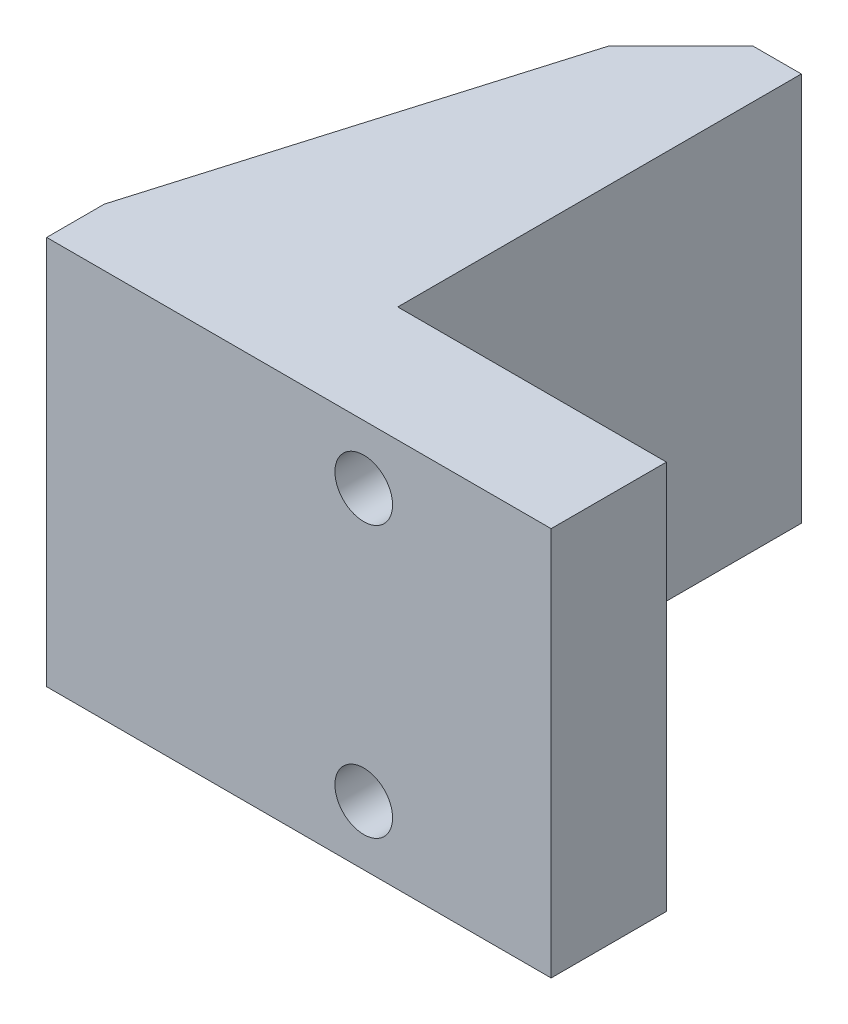
ISO-10303-21;
HEADER;
FILE_DESCRIPTION(('STEP AP214'),'2;1');
FILE_NAME('part.step','',(''),(''),'','','');
FILE_SCHEMA(('AUTOMOTIVE_DESIGN { 1 0 10303 214 1 1 1 1 }'));
ENDSEC;
DATA;
#1=APPLICATION_CONTEXT('core data for automotive mechanical design processes');
#2=APPLICATION_PROTOCOL_DEFINITION('international standard','automotive_design',2000,#1);
#3=PRODUCT_CONTEXT('',#1,'mechanical');
#4=PRODUCT('Part','Part','',(#3));
#5=PRODUCT_RELATED_PRODUCT_CATEGORY('part','',(#4));
#6=PRODUCT_DEFINITION_FORMATION('','',#4);
#7=PRODUCT_DEFINITION_CONTEXT('part definition',#1,'design');
#8=PRODUCT_DEFINITION('design','',#6,#7);
#9=PRODUCT_DEFINITION_SHAPE('','',#8);
#10=(LENGTH_UNIT() NAMED_UNIT(*) SI_UNIT(.MILLI.,.METRE.));
#11=(NAMED_UNIT(*) PLANE_ANGLE_UNIT() SI_UNIT($,.RADIAN.));
#12=(NAMED_UNIT(*) SI_UNIT($,.STERADIAN.) SOLID_ANGLE_UNIT());
#13=UNCERTAINTY_MEASURE_WITH_UNIT(LENGTH_MEASURE(1.E-05),#10,'distance_accuracy_value','');
#14=(GEOMETRIC_REPRESENTATION_CONTEXT(3) GLOBAL_UNCERTAINTY_ASSIGNED_CONTEXT((#13)) GLOBAL_UNIT_ASSIGNED_CONTEXT((#10,
#11,#12)) REPRESENTATION_CONTEXT('',''));
#15=CARTESIAN_POINT('',(0.,0.,0.));
#16=DIRECTION('',(0.,0.,1.));
#17=DIRECTION('',(1.,0.,0.));
#18=AXIS2_PLACEMENT_3D('',#15,#16,#17);
#19=CARTESIAN_POINT('',(0.,0.,5.08));
#20=DIRECTION('',(1.,0.,0.));
#21=DIRECTION('',(0.,0.,-1.));
#22=AXIS2_PLACEMENT_3D('',#19,#20,#21);
#23=PLANE('',#22);
#24=DIRECTION('',(0.,0.,1.));
#25=VECTOR('',#24,1.);
#26=CARTESIAN_POINT('',(0.,-14.605,-14.605));
#27=LINE('',#26,#25);
#28=CARTESIAN_POINT('',(0.,-14.605,-14.605));
#29=VERTEX_POINT('',#28);
#30=CARTESIAN_POINT('',(0.,-14.605,2.54));
#31=VERTEX_POINT('',#30);
#32=EDGE_CURVE('E62',#29,#31,#27,.T.);
#33=ORIENTED_EDGE('',*,*,#32,.T.);
#34=DIRECTION('',(0.,-1.,0.));
#35=VECTOR('',#34,1.);
#36=CARTESIAN_POINT('',(0.,0.,2.54));
#37=LINE('',#36,#35);
#38=CARTESIAN_POINT('',(0.,-2.54,2.54));
#39=VERTEX_POINT('',#38);
#40=EDGE_CURVE('E40',#39,#31,#37,.T.);
#41=ORIENTED_EDGE('',*,*,#40,.F.);
#42=DIRECTION('',(0.,0.,-1.));
#43=VECTOR('',#42,1.);
#44=CARTESIAN_POINT('',(0.,-2.54,-14.605));
#45=LINE('',#44,#43);
#46=CARTESIAN_POINT('',(0.,-2.54,-14.605));
#47=VERTEX_POINT('',#46);
#48=EDGE_CURVE('E177',#39,#47,#45,.T.);
#49=ORIENTED_EDGE('',*,*,#48,.T.);
#50=DIRECTION('',(0.,-1.,0.));
#51=VECTOR('',#50,1.);
#52=CARTESIAN_POINT('',(0.,0.,-14.605));
#53=LINE('',#52,#51);
#54=EDGE_CURVE('E260',#47,#29,#53,.T.);
#55=ORIENTED_EDGE('',*,*,#54,.T.);
#56=EDGE_LOOP('',(#33,#41,#49,#55));
#57=FACE_BOUND('',#56,.T.);
#58=ADVANCED_FACE('F36',(#57),#23,.F.);
#59=CARTESIAN_POINT('',(-5.08,0.,2.54));
#60=DIRECTION('',(0.,0.,1.));
#61=DIRECTION('',(0.,-1.,0.));
#62=AXIS2_PLACEMENT_3D('',#59,#60,#61);
#63=PLANE('',#62);
#64=DIRECTION('',(-1.,0.,0.));
#65=VECTOR('',#64,1.);
#66=CARTESIAN_POINT('',(0.,-14.605,2.54));
#67=LINE('',#66,#65);
#68=CARTESIAN_POINT('',(-5.08,-14.605,2.54));
#69=VERTEX_POINT('',#68);
#70=EDGE_CURVE('E155',#31,#69,#67,.T.);
#71=ORIENTED_EDGE('',*,*,#70,.T.);
#72=DIRECTION('',(0.,-1.,0.));
#73=VECTOR('',#72,1.);
#74=CARTESIAN_POINT('',(-5.08,0.,2.54));
#75=LINE('',#74,#73);
#76=CARTESIAN_POINT('',(-5.08,-2.54,2.54));
#77=VERTEX_POINT('',#76);
#78=EDGE_CURVE('E195',#77,#69,#75,.T.);
#79=ORIENTED_EDGE('',*,*,#78,.F.);
#80=DIRECTION('',(1.,0.,0.));
#81=VECTOR('',#80,1.);
#82=CARTESIAN_POINT('',(0.,-2.54,2.54));
#83=LINE('',#82,#81);
#84=EDGE_CURVE('E174',#77,#39,#83,.T.);
#85=ORIENTED_EDGE('',*,*,#84,.T.);
#86=ORIENTED_EDGE('',*,*,#40,.T.);
#87=EDGE_LOOP('',(#71,#79,#85,#86));
#88=FACE_BOUND('',#87,.T.);
#89=ADVANCED_FACE('F306',(#88),#63,.F.);
#90=CARTESIAN_POINT('',(0.,0.,0.));
#91=DIRECTION('',(0.,0.,1.));
#92=DIRECTION('',(1.,0.,0.));
#93=AXIS2_PLACEMENT_3D('',#90,#91,#92);
#94=PLANE('',#93);
#95=CARTESIAN_POINT('',(8.89,-2.5908,0.));
#96=DIRECTION('',(0.,0.,-1.));
#97=DIRECTION('',(-1.,0.,0.));
#98=AXIS2_PLACEMENT_3D('',#95,#96,#97);
#99=CIRCLE('',#98,2.54);
#100=CARTESIAN_POINT('',(6.35,-2.5908,0.));
#101=VERTEX_POINT('',#100);
#102=EDGE_CURVE('E225',#101,#101,#99,.T.);
#103=ORIENTED_EDGE('',*,*,#102,.F.);
#104=EDGE_LOOP('',(#103));
#105=FACE_BOUND('',#104,.T.);
#106=CARTESIAN_POINT('',(8.89,-14.5288,0.));
#107=DIRECTION('',(0.,0.,-1.));
#108=DIRECTION('',(-1.,0.,0.));
#109=AXIS2_PLACEMENT_3D('',#106,#107,#108);
#110=CIRCLE('',#109,2.54);
#111=CARTESIAN_POINT('',(6.35,-14.5288,0.));
#112=VERTEX_POINT('',#111);
#113=EDGE_CURVE('E211',#112,#112,#110,.T.);
#114=ORIENTED_EDGE('',*,*,#113,.F.);
#115=EDGE_LOOP('',(#114));
#116=FACE_BOUND('',#115,.T.);
#117=DIRECTION('',(1.,0.,0.));
#118=VECTOR('',#117,1.);
#119=CARTESIAN_POINT('',(0.,-17.145,0.));
#120=LINE('',#119,#118);
#121=CARTESIAN_POINT('',(5.30770467836258,-17.145,0.));
#122=VERTEX_POINT('',#121);
#123=CARTESIAN_POINT('',(17.145,-17.145,0.));
#124=VERTEX_POINT('',#123);
#125=EDGE_CURVE('E125',#122,#124,#120,.T.);
#126=ORIENTED_EDGE('',*,*,#125,.F.);
#127=DIRECTION('',(0.,1.,0.));
#128=VECTOR('',#127,1.);
#129=CARTESIAN_POINT('',(5.30770467836258,0.,0.));
#130=LINE('',#129,#128);
#131=CARTESIAN_POINT('',(5.30770467836258,0.,0.));
#132=VERTEX_POINT('',#131);
#133=EDGE_CURVE('E128',#122,#132,#130,.T.);
#134=ORIENTED_EDGE('',*,*,#133,.T.);
#135=DIRECTION('',(-1.,0.,0.));
#136=VECTOR('',#135,1.);
#137=CARTESIAN_POINT('',(0.,0.,0.));
#138=LINE('',#137,#136);
#139=CARTESIAN_POINT('',(17.145,0.,0.));
#140=VERTEX_POINT('',#139);
#141=EDGE_CURVE('E240',#140,#132,#138,.T.);
#142=ORIENTED_EDGE('',*,*,#141,.F.);
#143=DIRECTION('',(0.,1.,0.));
#144=VECTOR('',#143,1.);
#145=CARTESIAN_POINT('',(17.145,0.,0.));
#146=LINE('',#145,#144);
#147=EDGE_CURVE('E129',#124,#140,#146,.T.);
#148=ORIENTED_EDGE('',*,*,#147,.F.);
#149=EDGE_LOOP('',(#126,#134,#142,#148));
#150=FACE_BOUND('',#149,.T.);
#151=ADVANCED_FACE('F126',(#105,#116,#150),#94,.F.);
#152=CARTESIAN_POINT('',(8.89,-14.5288,5.08));
#153=DIRECTION('',(0.,0.,-1.));
#154=DIRECTION('',(-1.,0.,0.));
#155=AXIS2_PLACEMENT_3D('',#152,#153,#154);
#156=CYLINDRICAL_SURFACE('',#155,1.27);
#157=CARTESIAN_POINT('',(8.89,-14.5288,5.08));
#158=DIRECTION('',(0.,0.,-1.));
#159=DIRECTION('',(-1.,0.,0.));
#160=AXIS2_PLACEMENT_3D('',#157,#158,#159);
#161=CIRCLE('',#160,1.27);
#162=CARTESIAN_POINT('',(7.62,-14.5288,5.08));
#163=VERTEX_POINT('',#162);
#164=EDGE_CURVE('E229',#163,#163,#161,.T.);
#165=ORIENTED_EDGE('',*,*,#164,.F.);
#166=EDGE_LOOP('',(#165));
#167=FACE_BOUND('',#166,.T.);
#168=CARTESIAN_POINT('',(8.89,-14.5288,2.54));
#169=DIRECTION('',(0.,0.,-1.));
#170=DIRECTION('',(-1.,0.,0.));
#171=AXIS2_PLACEMENT_3D('',#168,#169,#170);
#172=CIRCLE('',#171,1.27);
#173=CARTESIAN_POINT('',(7.62,-14.5288,2.54));
#174=VERTEX_POINT('',#173);
#175=EDGE_CURVE('E216',#174,#174,#172,.F.);
#176=ORIENTED_EDGE('',*,*,#175,.F.);
#177=EDGE_LOOP('',(#176));
#178=FACE_BOUND('',#177,.T.);
#179=ADVANCED_FACE('F324',(#167,#178),#156,.F.);
#180=CARTESIAN_POINT('',(8.89,-2.5908,5.08));
#181=DIRECTION('',(0.,0.,-1.));
#182=DIRECTION('',(-1.,0.,0.));
#183=AXIS2_PLACEMENT_3D('',#180,#181,#182);
#184=CYLINDRICAL_SURFACE('',#183,1.27);
#185=CARTESIAN_POINT('',(8.89,-2.5908,5.08));
#186=DIRECTION('',(0.,0.,-1.));
#187=DIRECTION('',(-1.,0.,0.));
#188=AXIS2_PLACEMENT_3D('',#185,#186,#187);
#189=CIRCLE('',#188,1.27);
#190=CARTESIAN_POINT('',(7.62,-2.5908,5.08));
#191=VERTEX_POINT('',#190);
#192=EDGE_CURVE('E134',#191,#191,#189,.T.);
#193=ORIENTED_EDGE('',*,*,#192,.F.);
#194=EDGE_LOOP('',(#193));
#195=FACE_BOUND('',#194,.T.);
#196=CARTESIAN_POINT('',(8.89,-2.5908,2.54));
#197=DIRECTION('',(0.,0.,-1.));
#198=DIRECTION('',(-1.,0.,0.));
#199=AXIS2_PLACEMENT_3D('',#196,#197,#198);
#200=CIRCLE('',#199,1.27);
#201=CARTESIAN_POINT('',(7.62,-2.5908,2.54));
#202=VERTEX_POINT('',#201);
#203=EDGE_CURVE('E224',#202,#202,#200,.F.);
#204=ORIENTED_EDGE('',*,*,#203,.F.);
#205=EDGE_LOOP('',(#204));
#206=FACE_BOUND('',#205,.T.);
#207=ADVANCED_FACE('F316',(#195,#206),#184,.F.);
#208=CARTESIAN_POINT('',(0.,-17.145,5.08));
#209=DIRECTION('',(0.,1.,0.));
#210=DIRECTION('',(0.,0.,1.));
#211=AXIS2_PLACEMENT_3D('',#208,#209,#210);
#212=PLANE('',#211);
#213=DIRECTION('',(0.,0.,-1.));
#214=VECTOR('',#213,1.);
#215=CARTESIAN_POINT('',(5.30770467836258,-17.145,17.1741382607687));
#216=LINE('',#215,#214);
#217=CARTESIAN_POINT('',(5.30770467836258,-17.145,-17.78));
#218=VERTEX_POINT('',#217);
#219=EDGE_CURVE('E54',#122,#218,#216,.T.);
#220=ORIENTED_EDGE('',*,*,#219,.F.);
#221=ORIENTED_EDGE('',*,*,#125,.T.);
#222=DIRECTION('',(0.,0.,-1.));
#223=VECTOR('',#222,1.);
#224=CARTESIAN_POINT('',(17.145,-17.145,5.08));
#225=LINE('',#224,#223);
#226=CARTESIAN_POINT('',(17.145,-17.145,5.08));
#227=VERTEX_POINT('',#226);
#228=EDGE_CURVE('E257',#227,#124,#225,.T.);
#229=ORIENTED_EDGE('',*,*,#228,.F.);
#230=DIRECTION('',(1.,0.,0.));
#231=VECTOR('',#230,1.);
#232=CARTESIAN_POINT('',(0.,-17.145,5.08));
#233=LINE('',#232,#231);
#234=CARTESIAN_POINT('',(-5.08,-17.145,5.08));
#235=VERTEX_POINT('',#234);
#236=EDGE_CURVE('E236',#235,#227,#233,.T.);
#237=ORIENTED_EDGE('',*,*,#236,.F.);
#238=DIRECTION('',(0.,0.,1.));
#239=VECTOR('',#238,1.);
#240=CARTESIAN_POINT('',(-5.08,-17.145,5.08));
#241=LINE('',#240,#239);
#242=CARTESIAN_POINT('',(-5.08,-17.145,2.54));
#243=VERTEX_POINT('',#242);
#244=EDGE_CURVE('E200',#243,#235,#241,.T.);
#245=ORIENTED_EDGE('',*,*,#244,.F.);
#246=DIRECTION('',(0.284088329691374,0.,-0.958798112708387));
#247=VECTOR('',#246,1.);
#248=CARTESIAN_POINT('',(-5.08,-17.145,2.54));
#249=LINE('',#248,#247);
#250=CARTESIAN_POINT('',(0.,-17.145,-14.605));
#251=VERTEX_POINT('',#250);
#252=EDGE_CURVE('E156',#243,#251,#249,.T.);
#253=ORIENTED_EDGE('',*,*,#252,.T.);
#254=DIRECTION('',(-0.707106781186546,0.,0.707106781186549));
#255=VECTOR('',#254,1.);
#256=CARTESIAN_POINT('',(3.175,-17.145,-17.78));
#257=LINE('',#256,#255);
#258=CARTESIAN_POINT('',(3.175,-17.145,-17.78));
#259=VERTEX_POINT('',#258);
#260=EDGE_CURVE('E11',#251,#259,#257,.F.);
#261=ORIENTED_EDGE('',*,*,#260,.T.);
#262=DIRECTION('',(-1.,0.,0.));
#263=VECTOR('',#262,1.);
#264=CARTESIAN_POINT('',(0.,-17.145,-17.78));
#265=LINE('',#264,#263);
#266=EDGE_CURVE('E144',#218,#259,#265,.T.);
#267=ORIENTED_EDGE('',*,*,#266,.F.);
#268=EDGE_LOOP('',(#220,#221,#229,#237,#245,#253,#261,#267));
#269=FACE_BOUND('',#268,.T.);
#270=ADVANCED_FACE('F143',(#269),#212,.F.);
#271=CARTESIAN_POINT('',(17.145,0.,5.08));
#272=DIRECTION('',(-1.,0.,0.));
#273=DIRECTION('',(0.,-1.,0.));
#274=AXIS2_PLACEMENT_3D('',#271,#272,#273);
#275=PLANE('',#274);
#276=ORIENTED_EDGE('',*,*,#147,.T.);
#277=DIRECTION('',(0.,0.,-1.));
#278=VECTOR('',#277,1.);
#279=CARTESIAN_POINT('',(17.145,0.,5.08));
#280=LINE('',#279,#278);
#281=CARTESIAN_POINT('',(17.145,0.,5.08));
#282=VERTEX_POINT('',#281);
#283=EDGE_CURVE('E245',#282,#140,#280,.T.);
#284=ORIENTED_EDGE('',*,*,#283,.F.);
#285=DIRECTION('',(0.,1.,0.));
#286=VECTOR('',#285,1.);
#287=CARTESIAN_POINT('',(17.145,0.,5.08));
#288=LINE('',#287,#286);
#289=EDGE_CURVE('E239',#227,#282,#288,.T.);
#290=ORIENTED_EDGE('',*,*,#289,.F.);
#291=ORIENTED_EDGE('',*,*,#228,.T.);
#292=EDGE_LOOP('',(#276,#284,#290,#291));
#293=FACE_BOUND('',#292,.T.);
#294=ADVANCED_FACE('F315',(#293),#275,.F.);
#295=CARTESIAN_POINT('',(0.,0.,5.08));
#296=DIRECTION('',(0.,-1.,0.));
#297=DIRECTION('',(0.,0.,-1.));
#298=AXIS2_PLACEMENT_3D('',#295,#296,#297);
#299=PLANE('',#298);
#300=ORIENTED_EDGE('',*,*,#141,.T.);
#301=DIRECTION('',(0.,0.,-1.));
#302=VECTOR('',#301,1.);
#303=CARTESIAN_POINT('',(5.30770467836258,0.,17.1741382607687));
#304=LINE('',#303,#302);
#305=CARTESIAN_POINT('',(5.30770467836258,0.,-17.78));
#306=VERTEX_POINT('',#305);
#307=EDGE_CURVE('E139',#132,#306,#304,.T.);
#308=ORIENTED_EDGE('',*,*,#307,.T.);
#309=DIRECTION('',(1.,0.,0.));
#310=VECTOR('',#309,1.);
#311=CARTESIAN_POINT('',(0.,0.,-17.78));
#312=LINE('',#311,#310);
#313=CARTESIAN_POINT('',(3.175,0.,-17.78));
#314=VERTEX_POINT('',#313);
#315=EDGE_CURVE('E203',#314,#306,#312,.T.);
#316=ORIENTED_EDGE('',*,*,#315,.F.);
#317=DIRECTION('',(0.707106781186546,0.,-0.707106781186549));
#318=VECTOR('',#317,1.);
#319=CARTESIAN_POINT('',(3.175,0.,-17.78));
#320=LINE('',#319,#318);
#321=CARTESIAN_POINT('',(0.,0.,-14.605));
#322=VERTEX_POINT('',#321);
#323=EDGE_CURVE('E256',#314,#322,#320,.F.);
#324=ORIENTED_EDGE('',*,*,#323,.T.);
#325=DIRECTION('',(-0.284088329691374,0.,0.958798112708387));
#326=VECTOR('',#325,1.);
#327=CARTESIAN_POINT('',(-5.08,0.,2.54));
#328=LINE('',#327,#326);
#329=CARTESIAN_POINT('',(-5.08,0.,2.54));
#330=VERTEX_POINT('',#329);
#331=EDGE_CURVE('E171',#322,#330,#328,.T.);
#332=ORIENTED_EDGE('',*,*,#331,.T.);
#333=DIRECTION('',(0.,0.,-1.));
#334=VECTOR('',#333,1.);
#335=CARTESIAN_POINT('',(-5.08,0.,5.08));
#336=LINE('',#335,#334);
#337=CARTESIAN_POINT('',(-5.08,0.,5.08));
#338=VERTEX_POINT('',#337);
#339=EDGE_CURVE('E192',#338,#330,#336,.T.);
#340=ORIENTED_EDGE('',*,*,#339,.F.);
#341=DIRECTION('',(-1.,0.,0.));
#342=VECTOR('',#341,1.);
#343=CARTESIAN_POINT('',(0.,0.,5.08));
#344=LINE('',#343,#342);
#345=EDGE_CURVE('E243',#282,#338,#344,.T.);
#346=ORIENTED_EDGE('',*,*,#345,.F.);
#347=ORIENTED_EDGE('',*,*,#283,.T.);
#348=EDGE_LOOP('',(#300,#308,#316,#324,#332,#340,#346,#347));
#349=FACE_BOUND('',#348,.T.);
#350=ADVANCED_FACE('F293',(#349),#299,.F.);
#351=CARTESIAN_POINT('',(0.,0.,5.08));
#352=DIRECTION('',(0.,0.,1.));
#353=DIRECTION('',(1.,0.,0.));
#354=AXIS2_PLACEMENT_3D('',#351,#352,#353);
#355=PLANE('',#354);
#356=ORIENTED_EDGE('',*,*,#164,.T.);
#357=EDGE_LOOP('',(#356));
#358=FACE_BOUND('',#357,.T.);
#359=ORIENTED_EDGE('',*,*,#192,.T.);
#360=EDGE_LOOP('',(#359));
#361=FACE_BOUND('',#360,.T.);
#362=ORIENTED_EDGE('',*,*,#345,.T.);
#363=DIRECTION('',(0.,1.,0.));
#364=VECTOR('',#363,1.);
#365=CARTESIAN_POINT('',(-5.08,0.,5.08));
#366=LINE('',#365,#364);
#367=EDGE_CURVE('E188',#235,#338,#366,.T.);
#368=ORIENTED_EDGE('',*,*,#367,.F.);
#369=ORIENTED_EDGE('',*,*,#236,.T.);
#370=ORIENTED_EDGE('',*,*,#289,.T.);
#371=EDGE_LOOP('',(#362,#368,#369,#370));
#372=FACE_BOUND('',#371,.T.);
#373=ADVANCED_FACE('F285',(#358,#361,#372),#355,.T.);
#374=CARTESIAN_POINT('',(8.89,-2.5908,2.54));
#375=DIRECTION('',(0.,0.,-1.));
#376=DIRECTION('',(-1.,0.,0.));
#377=AXIS2_PLACEMENT_3D('',#374,#375,#376);
#378=PLANE('',#377);
#379=CARTESIAN_POINT('',(8.89,-2.5908,2.54));
#380=DIRECTION('',(0.,0.,-1.));
#381=DIRECTION('',(-1.,0.,0.));
#382=AXIS2_PLACEMENT_3D('',#379,#380,#381);
#383=CIRCLE('',#382,2.54);
#384=CARTESIAN_POINT('',(6.35,-2.5908,2.54));
#385=VERTEX_POINT('',#384);
#386=EDGE_CURVE('E220',#385,#385,#383,.T.);
#387=ORIENTED_EDGE('',*,*,#386,.T.);
#388=EDGE_LOOP('',(#387));
#389=FACE_BOUND('',#388,.T.);
#390=ORIENTED_EDGE('',*,*,#203,.T.);
#391=EDGE_LOOP('',(#390));
#392=FACE_BOUND('',#391,.T.);
#393=ADVANCED_FACE('F328',(#389,#392),#378,.T.);
#394=CARTESIAN_POINT('',(8.89,-2.5908,2.54));
#395=DIRECTION('',(0.,0.,-1.));
#396=DIRECTION('',(-1.,0.,0.));
#397=AXIS2_PLACEMENT_3D('',#394,#395,#396);
#398=CYLINDRICAL_SURFACE('',#397,2.54);
#399=ORIENTED_EDGE('',*,*,#386,.F.);
#400=EDGE_LOOP('',(#399));
#401=FACE_BOUND('',#400,.T.);
#402=ORIENTED_EDGE('',*,*,#102,.T.);
#403=EDGE_LOOP('',(#402));
#404=FACE_BOUND('',#403,.T.);
#405=ADVANCED_FACE('F336',(#401,#404),#398,.F.);
#406=CARTESIAN_POINT('',(8.89,-14.5288,2.54));
#407=DIRECTION('',(0.,0.,-1.));
#408=DIRECTION('',(-1.,0.,0.));
#409=AXIS2_PLACEMENT_3D('',#406,#407,#408);
#410=PLANE('',#409);
#411=CARTESIAN_POINT('',(8.89,-14.5288,2.54));
#412=DIRECTION('',(0.,0.,-1.));
#413=DIRECTION('',(-1.,0.,0.));
#414=AXIS2_PLACEMENT_3D('',#411,#412,#413);
#415=CIRCLE('',#414,2.54);
#416=CARTESIAN_POINT('',(6.35,-14.5288,2.54));
#417=VERTEX_POINT('',#416);
#418=EDGE_CURVE('E212',#417,#417,#415,.T.);
#419=ORIENTED_EDGE('',*,*,#418,.T.);
#420=EDGE_LOOP('',(#419));
#421=FACE_BOUND('',#420,.T.);
#422=ORIENTED_EDGE('',*,*,#175,.T.);
#423=EDGE_LOOP('',(#422));
#424=FACE_BOUND('',#423,.T.);
#425=ADVANCED_FACE('F339',(#421,#424),#410,.T.);
#426=CARTESIAN_POINT('',(8.89,-14.5288,2.54));
#427=DIRECTION('',(0.,0.,-1.));
#428=DIRECTION('',(-1.,0.,0.));
#429=AXIS2_PLACEMENT_3D('',#426,#427,#428);
#430=CYLINDRICAL_SURFACE('',#429,2.54);
#431=ORIENTED_EDGE('',*,*,#418,.F.);
#432=EDGE_LOOP('',(#431));
#433=FACE_BOUND('',#432,.T.);
#434=ORIENTED_EDGE('',*,*,#113,.T.);
#435=EDGE_LOOP('',(#434));
#436=FACE_BOUND('',#435,.T.);
#437=ADVANCED_FACE('F344',(#433,#436),#430,.F.);
#438=CARTESIAN_POINT('',(0.,0.,-17.78));
#439=DIRECTION('',(0.,0.,1.));
#440=DIRECTION('',(1.,0.,0.));
#441=AXIS2_PLACEMENT_3D('',#438,#439,#440);
#442=PLANE('',#441);
#443=ORIENTED_EDGE('',*,*,#315,.T.);
#444=DIRECTION('',(0.,1.,0.));
#445=VECTOR('',#444,1.);
#446=CARTESIAN_POINT('',(5.30770467836258,0.,-17.78));
#447=LINE('',#446,#445);
#448=EDGE_CURVE('E146',#218,#306,#447,.T.);
#449=ORIENTED_EDGE('',*,*,#448,.F.);
#450=ORIENTED_EDGE('',*,*,#266,.T.);
#451=DIRECTION('',(0.,1.,0.));
#452=VECTOR('',#451,1.);
#453=CARTESIAN_POINT('',(3.175,0.,-17.78));
#454=LINE('',#453,#452);
#455=EDGE_CURVE('E252',#259,#314,#454,.T.);
#456=ORIENTED_EDGE('',*,*,#455,.T.);
#457=EDGE_LOOP('',(#443,#449,#450,#456));
#458=FACE_BOUND('',#457,.T.);
#459=ADVANCED_FACE('F303',(#458),#442,.F.);
#460=CARTESIAN_POINT('',(-5.08,0.,0.));
#461=DIRECTION('',(1.,0.,0.));
#462=DIRECTION('',(0.,0.,-1.));
#463=AXIS2_PLACEMENT_3D('',#460,#461,#462);
#464=PLANE('',#463);
#465=ORIENTED_EDGE('',*,*,#367,.T.);
#466=ORIENTED_EDGE('',*,*,#339,.T.);
#467=EDGE_CURVE('E196',#330,#77,#75,.T.);
#468=ORIENTED_EDGE('',*,*,#467,.T.);
#469=ORIENTED_EDGE('',*,*,#78,.T.);
#470=DIRECTION('',(0.,-1.,0.));
#471=VECTOR('',#470,1.);
#472=CARTESIAN_POINT('',(-5.08,-14.605,2.54));
#473=LINE('',#472,#471);
#474=EDGE_CURVE('E163',#69,#243,#473,.T.);
#475=ORIENTED_EDGE('',*,*,#474,.T.);
#476=ORIENTED_EDGE('',*,*,#244,.T.);
#477=EDGE_LOOP('',(#465,#466,#468,#469,#475,#476));
#478=FACE_BOUND('',#477,.T.);
#479=ADVANCED_FACE('F281',(#478),#464,.F.);
#480=CARTESIAN_POINT('',(3.175,0.,-17.78));
#481=DIRECTION('',(0.707106781186549,0.,0.707106781186546));
#482=DIRECTION('',(0.,1.,0.));
#483=AXIS2_PLACEMENT_3D('',#480,#481,#482);
#484=PLANE('',#483);
#485=ORIENTED_EDGE('',*,*,#260,.F.);
#486=DIRECTION('',(0.,-1.,0.));
#487=VECTOR('',#486,1.);
#488=CARTESIAN_POINT('',(0.,-14.605,-14.605));
#489=LINE('',#488,#487);
#490=EDGE_CURVE('E167',#29,#251,#489,.T.);
#491=ORIENTED_EDGE('',*,*,#490,.F.);
#492=ORIENTED_EDGE('',*,*,#54,.F.);
#493=EDGE_CURVE('E47',#322,#47,#53,.T.);
#494=ORIENTED_EDGE('',*,*,#493,.F.);
#495=ORIENTED_EDGE('',*,*,#323,.F.);
#496=ORIENTED_EDGE('',*,*,#455,.F.);
#497=EDGE_LOOP('',(#485,#491,#492,#494,#495,#496));
#498=FACE_BOUND('',#497,.T.);
#499=ADVANCED_FACE('F38',(#498),#484,.F.);
#500=CARTESIAN_POINT('',(-5.08,-2.54,2.54));
#501=DIRECTION('',(-0.958798112708387,0.,-0.284088329691374));
#502=DIRECTION('',(-0.284088329691374,0.,0.958798112708387));
#503=AXIS2_PLACEMENT_3D('',#500,#501,#502);
#504=PLANE('',#503);
#505=ORIENTED_EDGE('',*,*,#331,.F.);
#506=ORIENTED_EDGE('',*,*,#493,.T.);
#507=DIRECTION('',(-0.284088329691374,0.,0.958798112708387));
#508=VECTOR('',#507,1.);
#509=CARTESIAN_POINT('',(-5.08,-2.54,2.54));
#510=LINE('',#509,#508);
#511=EDGE_CURVE('E181',#47,#77,#510,.T.);
#512=ORIENTED_EDGE('',*,*,#511,.T.);
#513=ORIENTED_EDGE('',*,*,#467,.F.);
#514=EDGE_LOOP('',(#505,#506,#512,#513));
#515=FACE_BOUND('',#514,.T.);
#516=ADVANCED_FACE('F292',(#515),#504,.T.);
#517=CARTESIAN_POINT('',(0.,-2.54,0.));
#518=DIRECTION('',(0.,1.,0.));
#519=DIRECTION('',(0.,0.,1.));
#520=AXIS2_PLACEMENT_3D('',#517,#518,#519);
#521=PLANE('',#520);
#522=ORIENTED_EDGE('',*,*,#84,.F.);
#523=ORIENTED_EDGE('',*,*,#511,.F.);
#524=ORIENTED_EDGE('',*,*,#48,.F.);
#525=EDGE_LOOP('',(#522,#523,#524));
#526=FACE_BOUND('',#525,.T.);
#527=ADVANCED_FACE('F301',(#526),#521,.F.);
#528=CARTESIAN_POINT('',(-5.08,-14.605,2.54));
#529=DIRECTION('',(-0.958798112708387,0.,-0.284088329691374));
#530=DIRECTION('',(-0.284088329691374,0.,0.958798112708387));
#531=AXIS2_PLACEMENT_3D('',#528,#529,#530);
#532=PLANE('',#531);
#533=ORIENTED_EDGE('',*,*,#252,.F.);
#534=ORIENTED_EDGE('',*,*,#474,.F.);
#535=DIRECTION('',(0.284088329691374,0.,-0.958798112708387));
#536=VECTOR('',#535,1.);
#537=CARTESIAN_POINT('',(-5.08,-14.605,2.54));
#538=LINE('',#537,#536);
#539=EDGE_CURVE('E159',#69,#29,#538,.T.);
#540=ORIENTED_EDGE('',*,*,#539,.T.);
#541=ORIENTED_EDGE('',*,*,#490,.T.);
#542=EDGE_LOOP('',(#533,#534,#540,#541));
#543=FACE_BOUND('',#542,.T.);
#544=ADVANCED_FACE('F277',(#543),#532,.T.);
#545=CARTESIAN_POINT('',(0.,-14.605,0.));
#546=DIRECTION('',(0.,-1.,0.));
#547=DIRECTION('',(0.,0.,-1.));
#548=AXIS2_PLACEMENT_3D('',#545,#546,#547);
#549=PLANE('',#548);
#550=ORIENTED_EDGE('',*,*,#32,.F.);
#551=ORIENTED_EDGE('',*,*,#539,.F.);
#552=ORIENTED_EDGE('',*,*,#70,.F.);
#553=EDGE_LOOP('',(#550,#551,#552));
#554=FACE_BOUND('',#553,.T.);
#555=ADVANCED_FACE('F273',(#554),#549,.F.);
#556=CARTESIAN_POINT('',(5.30770467836258,0.,17.1741382607687));
#557=DIRECTION('',(-1.,0.,0.));
#558=DIRECTION('',(0.,-1.,0.));
#559=AXIS2_PLACEMENT_3D('',#556,#557,#558);
#560=PLANE('',#559);
#561=ORIENTED_EDGE('',*,*,#219,.T.);
#562=ORIENTED_EDGE('',*,*,#448,.T.);
#563=ORIENTED_EDGE('',*,*,#307,.F.);
#564=ORIENTED_EDGE('',*,*,#133,.F.);
#565=EDGE_LOOP('',(#561,#562,#563,#564));
#566=FACE_BOUND('',#565,.T.);
#567=ADVANCED_FACE('F137',(#566),#560,.F.);
#568=CLOSED_SHELL('',(#58,#89,#151,#179,#207,#270,#294,#350,#373,#393,#405,#425,#437,#459,#479,
#499,#516,#527,#544,#555,#567));
#569=MANIFOLD_SOLID_BREP('B2',#568);
#570=ADVANCED_BREP_SHAPE_REPRESENTATION('',(#18,#569),#14);
#571=SHAPE_DEFINITION_REPRESENTATION(#9,#570);
ENDSEC;
END-ISO-10303-21;
